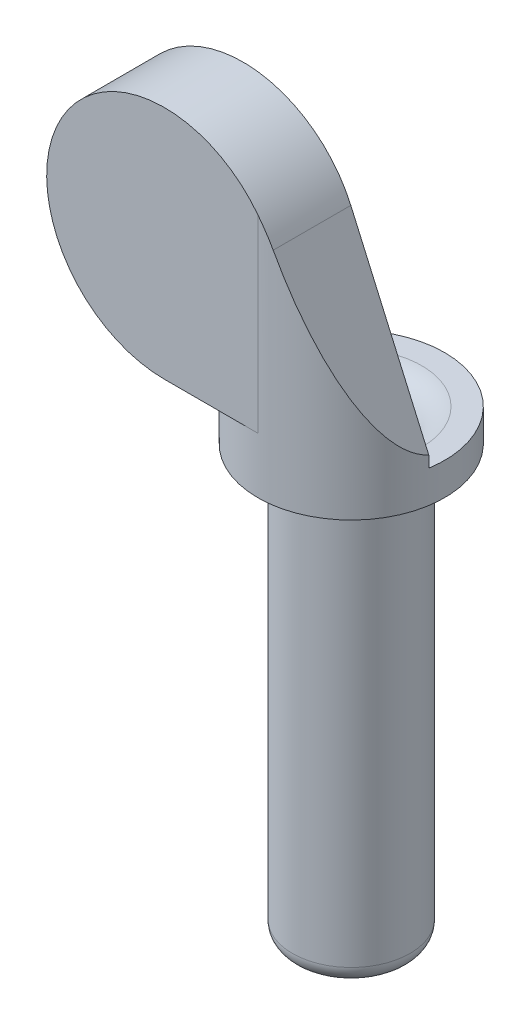
ISO-10303-21;
HEADER;
FILE_DESCRIPTION(('STEP AP214'),'2;1');
FILE_NAME('part.step','',(''),(''),'','','');
FILE_SCHEMA(('AUTOMOTIVE_DESIGN { 1 0 10303 214 1 1 1 1 }'));
ENDSEC;
DATA;
#1=APPLICATION_CONTEXT('core data for automotive mechanical design processes');
#2=APPLICATION_PROTOCOL_DEFINITION('international standard','automotive_design',2000,#1);
#3=PRODUCT_CONTEXT('',#1,'mechanical');
#4=PRODUCT('Part','Part','',(#3));
#5=PRODUCT_RELATED_PRODUCT_CATEGORY('part','',(#4));
#6=PRODUCT_DEFINITION_FORMATION('','',#4);
#7=PRODUCT_DEFINITION_CONTEXT('part definition',#1,'design');
#8=PRODUCT_DEFINITION('design','',#6,#7);
#9=PRODUCT_DEFINITION_SHAPE('','',#8);
#10=(LENGTH_UNIT() NAMED_UNIT(*) SI_UNIT(.MILLI.,.METRE.));
#11=(NAMED_UNIT(*) PLANE_ANGLE_UNIT() SI_UNIT($,.RADIAN.));
#12=(NAMED_UNIT(*) SI_UNIT($,.STERADIAN.) SOLID_ANGLE_UNIT());
#13=UNCERTAINTY_MEASURE_WITH_UNIT(LENGTH_MEASURE(1.E-05),#10,'distance_accuracy_value','');
#14=(GEOMETRIC_REPRESENTATION_CONTEXT(3) GLOBAL_UNCERTAINTY_ASSIGNED_CONTEXT((#13)) GLOBAL_UNIT_ASSIGNED_CONTEXT((#10,
#11,#12)) REPRESENTATION_CONTEXT('',''));
#15=CARTESIAN_POINT('',(0.,0.,0.));
#16=DIRECTION('',(0.,0.,1.));
#17=DIRECTION('',(1.,0.,0.));
#18=AXIS2_PLACEMENT_3D('',#15,#16,#17);
#19=CARTESIAN_POINT('',(-3.175,20.5,3.175));
#20=DIRECTION('',(0.,0.,1.));
#21=DIRECTION('',(1.,0.,0.));
#22=AXIS2_PLACEMENT_3D('',#19,#20,#21);
#23=PLANE('',#22);
#24=CARTESIAN_POINT('',(-3.175,20.5,3.175));
#25=DIRECTION('',(0.,0.,1.));
#26=DIRECTION('',(1.,0.,0.));
#27=AXIS2_PLACEMENT_3D('',#24,#25,#26);
#28=CIRCLE('',#27,4.);
#29=CARTESIAN_POINT('',(0.,22.9329765720204,3.175));
#30=VERTEX_POINT('',#29);
#31=CARTESIAN_POINT('',(-3.175,16.5,3.175));
#32=VERTEX_POINT('',#31);
#33=EDGE_CURVE('E124',#30,#32,#28,.T.);
#34=ORIENTED_EDGE('',*,*,#33,.T.);
#35=DIRECTION('',(-1.,0.,0.));
#36=VECTOR('',#35,1.);
#37=CARTESIAN_POINT('',(-3.175,16.5,3.175));
#38=LINE('',#37,#36);
#39=CARTESIAN_POINT('',(0.,16.5,3.175));
#40=VERTEX_POINT('',#39);
#41=EDGE_CURVE('E117',#40,#32,#38,.T.);
#42=ORIENTED_EDGE('',*,*,#41,.F.);
#43=DIRECTION('',(0.,-1.,0.));
#44=VECTOR('',#43,1.);
#45=CARTESIAN_POINT('',(0.,24.5,3.175));
#46=LINE('',#45,#44);
#47=EDGE_CURVE('E393',#30,#40,#46,.T.);
#48=ORIENTED_EDGE('',*,*,#47,.F.);
#49=EDGE_LOOP('',(#34,#42,#48));
#50=FACE_BOUND('',#49,.T.);
#51=ADVANCED_FACE('F41',(#50),#23,.T.);
#52=CARTESIAN_POINT('',(0.,16.,0.));
#53=DIRECTION('',(0.,-1.,0.));
#54=DIRECTION('',(0.,0.,-1.));
#55=AXIS2_PLACEMENT_3D('',#52,#53,#54);
#56=CYLINDRICAL_SURFACE('',#55,2.);
#57=CARTESIAN_POINT('',(0.,0.6,0.));
#58=DIRECTION('',(0.,1.,0.));
#59=DIRECTION('',(0.,0.,1.));
#60=AXIS2_PLACEMENT_3D('',#57,#58,#59);
#61=CIRCLE('',#60,2.);
#62=CARTESIAN_POINT('',(0.,0.6,2.));
#63=VERTEX_POINT('',#62);
#64=EDGE_CURVE('E161',#63,#63,#61,.T.);
#65=ORIENTED_EDGE('',*,*,#64,.T.);
#66=EDGE_LOOP('',(#65));
#67=FACE_BOUND('',#66,.T.);
#68=CARTESIAN_POINT('',(0.,14.6,0.));
#69=DIRECTION('',(0.,1.,0.));
#70=DIRECTION('',(0.,0.,1.));
#71=AXIS2_PLACEMENT_3D('',#68,#69,#70);
#72=CIRCLE('',#71,2.);
#73=CARTESIAN_POINT('',(0.,14.6,2.));
#74=VERTEX_POINT('',#73);
#75=EDGE_CURVE('E166',#74,#74,#72,.T.);
#76=ORIENTED_EDGE('',*,*,#75,.F.);
#77=EDGE_LOOP('',(#76));
#78=FACE_BOUND('',#77,.T.);
#79=ADVANCED_FACE('F219',(#67,#78),#56,.T.);
#80=CARTESIAN_POINT('',(0.,0.,0.));
#81=DIRECTION('',(0.,1.,0.));
#82=DIRECTION('',(0.,0.,1.));
#83=AXIS2_PLACEMENT_3D('',#80,#81,#82);
#84=PLANE('',#83);
#85=CARTESIAN_POINT('',(0.,0.,0.));
#86=DIRECTION('',(0.,1.,0.));
#87=DIRECTION('',(0.,0.,1.));
#88=AXIS2_PLACEMENT_3D('',#85,#86,#87);
#89=CIRCLE('',#88,1.4);
#90=CARTESIAN_POINT('',(1.3076696830622,0.,0.500000000000001));
#91=VERTEX_POINT('',#90);
#92=CARTESIAN_POINT('',(-1.3076696830622,0.,0.500000000000002));
#93=VERTEX_POINT('',#92);
#94=EDGE_CURVE('E165',#91,#93,#89,.F.);
#95=ORIENTED_EDGE('',*,*,#94,.T.);
#96=DIRECTION('',(1.,0.,0.));
#97=VECTOR('',#96,1.);
#98=CARTESIAN_POINT('',(-1.3076696830622,0.,0.500000000000002));
#99=LINE('',#98,#97);
#100=EDGE_CURVE('E150',#91,#93,#99,.F.);
#101=ORIENTED_EDGE('',*,*,#100,.F.);
#102=EDGE_LOOP('',(#95,#101));
#103=FACE_BOUND('',#102,.T.);
#104=ADVANCED_FACE('F259',(#103),#84,.F.);
#105=CARTESIAN_POINT('',(0.,0.6,0.));
#106=DIRECTION('',(0.,1.,0.));
#107=DIRECTION('',(0.,0.,1.));
#108=AXIS2_PLACEMENT_3D('',#105,#106,#107);
#109=TOROIDAL_SURFACE('',#108,1.4,0.6);
#110=CARTESIAN_POINT('',(0.,0.,0.));
#111=DIRECTION('',(0.,-1.,0.));
#112=DIRECTION('',(0.,0.,-1.));
#113=AXIS2_PLACEMENT_3D('',#110,#111,#112);
#114=CIRCLE('',#113,1.4);
#115=EDGE_CURVE('E171',#93,#91,#114,.T.);
#116=ORIENTED_EDGE('',*,*,#115,.F.);
#117=ORIENTED_EDGE('',*,*,#94,.F.);
#118=EDGE_LOOP('',(#116,#117));
#119=FACE_BOUND('',#118,.T.);
#120=ORIENTED_EDGE('',*,*,#64,.F.);
#121=EDGE_LOOP('',(#120));
#122=FACE_BOUND('',#121,.T.);
#123=ADVANCED_FACE('F251',(#119,#122),#109,.T.);
#124=CARTESIAN_POINT('',(0.,14.6,0.));
#125=DIRECTION('',(0.,1.,0.));
#126=DIRECTION('',(0.,0.,1.));
#127=AXIS2_PLACEMENT_3D('',#124,#125,#126);
#128=CYLINDRICAL_SURFACE('',#127,3.175);
#129=CARTESIAN_POINT('',(0.,15.7,0.));
#130=DIRECTION('',(0.,1.,0.));
#131=DIRECTION('',(0.,0.,-1.));
#132=AXIS2_PLACEMENT_3D('',#129,#130,#131);
#133=CIRCLE('',#132,3.175);
#134=CARTESIAN_POINT('',(3.13538275175456,15.7,0.5));
#135=VERTEX_POINT('',#134);
#136=CARTESIAN_POINT('',(-3.13538275175456,15.7,0.500000000000001));
#137=VERTEX_POINT('',#136);
#138=EDGE_CURVE('E395',#135,#137,#133,.T.);
#139=ORIENTED_EDGE('',*,*,#138,.F.);
#140=DIRECTION('',(0.,-1.,0.));
#141=VECTOR('',#140,1.);
#142=CARTESIAN_POINT('',(3.13538275175456,24.5,0.5));
#143=LINE('',#142,#141);
#144=CARTESIAN_POINT('',(3.13538275175456,16.090041882608,0.5));
#145=VERTEX_POINT('',#144);
#146=EDGE_CURVE('E388',#145,#135,#143,.T.);
#147=ORIENTED_EDGE('',*,*,#146,.F.);
#148=CARTESIAN_POINT('',(0.,23.2161240354019,0.));
#149=DIRECTION('',(-0.915319454600052,-0.402728563713406,0.));
#150=DIRECTION('',(0.402728563713406,-0.915319454600052,0.));
#151=AXIS2_PLACEMENT_3D('',#148,#149,#150);
#152=ELLIPSE('',#151,7.88372190620052,3.17500000000005);
#153=CARTESIAN_POINT('',(0.486277818400209,22.1109142548536,3.13754026003363));
#154=VERTEX_POINT('',#153);
#155=EDGE_CURVE('E236',#154,#145,#152,.F.);
#156=ORIENTED_EDGE('',*,*,#155,.F.);
#157=CARTESIAN_POINT('',(0.,22.9329765720204,3.175));
#158=CARTESIAN_POINT('',(0.0486745483315564,22.8694630838091,3.17499631223018));
#159=CARTESIAN_POINT('',(0.0954294657140837,22.8044949193422,3.17388086811998));
#160=CARTESIAN_POINT('',(0.184770710929604,22.6721607264799,3.16993406051462));
#161=CARTESIAN_POINT('',(0.227372222844302,22.6048047622013,3.16710924202384));
#162=CARTESIAN_POINT('',(0.308448202056237,22.4677223495491,3.16024379635572));
#163=CARTESIAN_POINT('',(0.346922861070821,22.3979960114922,3.15620322569064));
#164=CARTESIAN_POINT('',(0.419767709006462,22.2561407477755,3.14734224861686));
#165=CARTESIAN_POINT('',(0.454121664912938,22.184003664894,3.14251892347416));
#166=CARTESIAN_POINT('',(0.486277818400206,22.1109142548536,3.13754026003363));
#167=B_SPLINE_CURVE_WITH_KNOTS('',3,(#157,#158,#159,#160,#161,#162,#163,#164,#165,#166),
.UNSPECIFIED.,.F.,.F.,(4,2,2,2,4),(0.,0.239997366257403,0.47908157291789,0.718154667851996,
0.958140614410714),.UNSPECIFIED.);
#168=EDGE_CURVE('E226',#30,#154,#167,.T.);
#169=ORIENTED_EDGE('',*,*,#168,.F.);
#170=ORIENTED_EDGE('',*,*,#47,.T.);
#171=CARTESIAN_POINT('',(0.,16.5,0.));
#172=DIRECTION('',(0.,1.,0.));
#173=DIRECTION('',(0.,0.,-1.));
#174=AXIS2_PLACEMENT_3D('',#171,#172,#173);
#175=CIRCLE('',#174,3.175);
#176=CARTESIAN_POINT('',(-3.13538275175456,16.5,0.500000000000001));
#177=VERTEX_POINT('',#176);
#178=EDGE_CURVE('E136',#177,#40,#175,.T.);
#179=ORIENTED_EDGE('',*,*,#178,.F.);
#180=DIRECTION('',(0.,1.,0.));
#181=VECTOR('',#180,1.);
#182=CARTESIAN_POINT('',(-3.13538275175456,15.7,0.500000000000001));
#183=LINE('',#182,#181);
#184=EDGE_CURVE('E133',#137,#177,#183,.T.);
#185=ORIENTED_EDGE('',*,*,#184,.F.);
#186=EDGE_LOOP('',(#139,#147,#156,#169,#170,#179,#185));
#187=FACE_BOUND('',#186,.T.);
#188=CARTESIAN_POINT('',(0.,14.6,0.));
#189=DIRECTION('',(0.,1.,0.));
#190=DIRECTION('',(0.,0.,1.));
#191=AXIS2_PLACEMENT_3D('',#188,#189,#190);
#192=CIRCLE('',#191,3.175);
#193=CARTESIAN_POINT('',(0.,14.6,3.175));
#194=VERTEX_POINT('',#193);
#195=EDGE_CURVE('E143',#194,#194,#192,.T.);
#196=ORIENTED_EDGE('',*,*,#195,.T.);
#197=EDGE_LOOP('',(#196));
#198=FACE_BOUND('',#197,.T.);
#199=ADVANCED_FACE('F205',(#187,#198),#128,.T.);
#200=CARTESIAN_POINT('',(0.,14.6,0.));
#201=DIRECTION('',(0.,1.,0.));
#202=DIRECTION('',(0.,0.,1.));
#203=AXIS2_PLACEMENT_3D('',#200,#201,#202);
#204=PLANE('',#203);
#205=ORIENTED_EDGE('',*,*,#75,.T.);
#206=EDGE_LOOP('',(#205));
#207=FACE_BOUND('',#206,.T.);
#208=ORIENTED_EDGE('',*,*,#195,.F.);
#209=EDGE_LOOP('',(#208));
#210=FACE_BOUND('',#209,.T.);
#211=ADVANCED_FACE('F211',(#207,#210),#204,.F.);
#212=CARTESIAN_POINT('',(-3.175,20.5,2.5));
#213=DIRECTION('',(0.,0.,-1.));
#214=DIRECTION('',(-1.,0.,0.));
#215=AXIS2_PLACEMENT_3D('',#212,#213,#214);
#216=PLANE('',#215);
#217=CARTESIAN_POINT('',(-3.175,20.5,2.5));
#218=DIRECTION('',(0.,0.,-1.));
#219=DIRECTION('',(-1.,0.,0.));
#220=AXIS2_PLACEMENT_3D('',#217,#218,#219);
#221=CIRCLE('',#220,1.65);
#222=CARTESIAN_POINT('',(-4.825,20.5,2.5));
#223=VERTEX_POINT('',#222);
#224=EDGE_CURVE('E147',#223,#223,#221,.T.);
#225=ORIENTED_EDGE('',*,*,#224,.T.);
#226=EDGE_LOOP('',(#225));
#227=FACE_BOUND('',#226,.T.);
#228=ADVANCED_FACE('F207',(#227),#216,.T.);
#229=CARTESIAN_POINT('',(-3.175,20.5,3.175));
#230=DIRECTION('',(0.,0.,-1.));
#231=DIRECTION('',(-1.,0.,0.));
#232=AXIS2_PLACEMENT_3D('',#229,#230,#231);
#233=CYLINDRICAL_SURFACE('',#232,4.);
#234=ORIENTED_EDGE('',*,*,#33,.F.);
#235=ORIENTED_EDGE('',*,*,#168,.T.);
#236=DIRECTION('',(0.,0.,-1.));
#237=VECTOR('',#236,1.);
#238=CARTESIAN_POINT('',(0.486277818400209,22.1109142548536,3.175));
#239=LINE('',#238,#237);
#240=CARTESIAN_POINT('',(0.486277818400208,22.1109142548536,0.5));
#241=VERTEX_POINT('',#240);
#242=EDGE_CURVE('E123',#154,#241,#239,.T.);
#243=ORIENTED_EDGE('',*,*,#242,.T.);
#244=CARTESIAN_POINT('',(-3.175,20.5,0.500000000000001));
#245=DIRECTION('',(0.,0.,-1.));
#246=DIRECTION('',(-1.,0.,0.));
#247=AXIS2_PLACEMENT_3D('',#244,#245,#246);
#248=CIRCLE('',#247,4.);
#249=CARTESIAN_POINT('',(-3.175,16.5,0.500000000000001));
#250=VERTEX_POINT('',#249);
#251=EDGE_CURVE('E130',#250,#241,#248,.T.);
#252=ORIENTED_EDGE('',*,*,#251,.F.);
#253=DIRECTION('',(0.,0.,-1.));
#254=VECTOR('',#253,1.);
#255=CARTESIAN_POINT('',(-3.175,16.5,3.175));
#256=LINE('',#255,#254);
#257=EDGE_CURVE('E112',#32,#250,#256,.T.);
#258=ORIENTED_EDGE('',*,*,#257,.F.);
#259=EDGE_LOOP('',(#234,#235,#243,#252,#258));
#260=FACE_BOUND('',#259,.T.);
#261=ADVANCED_FACE('F138',(#260),#233,.T.);
#262=CARTESIAN_POINT('',(3.175,16.,3.175));
#263=DIRECTION('',(-0.915319454600052,-0.402728563713406,0.));
#264=DIRECTION('',(0.402728563713406,-0.915319454600052,0.));
#265=AXIS2_PLACEMENT_3D('',#262,#263,#264);
#266=PLANE('',#265);
#267=ORIENTED_EDGE('',*,*,#242,.F.);
#268=ORIENTED_EDGE('',*,*,#155,.T.);
#269=DIRECTION('',(0.402728563713406,-0.915319454600052,0.));
#270=VECTOR('',#269,1.);
#271=CARTESIAN_POINT('',(3.175,16.,0.5));
#272=LINE('',#271,#270);
#273=EDGE_CURVE('E142',#241,#145,#272,.T.);
#274=ORIENTED_EDGE('',*,*,#273,.F.);
#275=EDGE_LOOP('',(#267,#268,#274));
#276=FACE_BOUND('',#275,.T.);
#277=ADVANCED_FACE('F215',(#276),#266,.F.);
#278=CARTESIAN_POINT('',(-3.175,20.5,2.5));
#279=DIRECTION('',(0.,0.,-1.));
#280=DIRECTION('',(-1.,0.,0.));
#281=AXIS2_PLACEMENT_3D('',#278,#279,#280);
#282=CYLINDRICAL_SURFACE('',#281,1.65);
#283=CARTESIAN_POINT('',(-3.175,20.5,0.800000000000001));
#284=DIRECTION('',(0.,0.,-1.));
#285=DIRECTION('',(-1.,0.,0.));
#286=AXIS2_PLACEMENT_3D('',#283,#284,#285);
#287=CIRCLE('',#286,1.65);
#288=CARTESIAN_POINT('',(-4.825,20.5,0.800000000000001));
#289=VERTEX_POINT('',#288);
#290=EDGE_CURVE('E175',#289,#289,#287,.T.);
#291=ORIENTED_EDGE('',*,*,#290,.T.);
#292=EDGE_LOOP('',(#291));
#293=FACE_BOUND('',#292,.T.);
#294=ORIENTED_EDGE('',*,*,#224,.F.);
#295=EDGE_LOOP('',(#294));
#296=FACE_BOUND('',#295,.T.);
#297=ADVANCED_FACE('F204',(#293,#296),#282,.F.);
#298=CARTESIAN_POINT('',(3.175,24.5,0.5));
#299=DIRECTION('',(0.,0.,-1.));
#300=DIRECTION('',(-1.,0.,0.));
#301=AXIS2_PLACEMENT_3D('',#298,#299,#300);
#302=PLANE('',#301);
#303=ORIENTED_EDGE('',*,*,#184,.T.);
#304=DIRECTION('',(1.,0.,0.));
#305=VECTOR('',#304,1.);
#306=CARTESIAN_POINT('',(-3.13538275175456,16.5,0.500000000000001));
#307=LINE('',#306,#305);
#308=EDGE_CURVE('E115',#250,#177,#307,.T.);
#309=ORIENTED_EDGE('',*,*,#308,.F.);
#310=ORIENTED_EDGE('',*,*,#251,.T.);
#311=ORIENTED_EDGE('',*,*,#273,.T.);
#312=ORIENTED_EDGE('',*,*,#146,.T.);
#313=DIRECTION('',(1.,0.,0.));
#314=VECTOR('',#313,1.);
#315=CARTESIAN_POINT('',(-3.13538275175456,15.7,0.500000000000001));
#316=LINE('',#315,#314);
#317=CARTESIAN_POINT('',(2.3473389188611,15.7,0.5));
#318=VERTEX_POINT('',#317);
#319=EDGE_CURVE('E390',#318,#135,#316,.T.);
#320=ORIENTED_EDGE('',*,*,#319,.F.);
#321=CARTESIAN_POINT('',(2.3473389188611,15.7,0.5));
#322=CARTESIAN_POINT('',(2.28786296516682,15.7000444900482,0.5));
#323=CARTESIAN_POINT('',(2.22841631556277,15.6949271495817,0.5));
#324=CARTESIAN_POINT('',(2.11127449472661,15.6748138887513,0.5));
#325=CARTESIAN_POINT('',(2.05357765257894,15.6598277242419,0.5));
#326=CARTESIAN_POINT('',(1.94149693667241,15.6204176146967,0.5));
#327=CARTESIAN_POINT('',(1.88711350836565,15.5959924039118,0.5));
#328=CARTESIAN_POINT('',(1.78318025890557,15.53840998603,0.5));
#329=CARTESIAN_POINT('',(1.73363065291909,15.5052523904733,0.5));
#330=CARTESIAN_POINT('',(1.64058887172607,15.4309005014392,0.5));
#331=CARTESIAN_POINT('',(1.59712605674738,15.3896694099007,0.5));
#332=CARTESIAN_POINT('',(1.51792570118299,15.3003220423714,0.5));
#333=CARTESIAN_POINT('',(1.48218939306941,15.2522046699663,0.5));
#334=CARTESIAN_POINT('',(1.4205559687986,15.1516293057197,0.5));
#335=CARTESIAN_POINT('',(1.39444157729436,15.0993046148898,0.5));
#336=CARTESIAN_POINT('',(1.35202443409821,14.9908569326868,0.5));
#337=CARTESIAN_POINT('',(1.33570585786261,14.9347402311562,0.5));
#338=CARTESIAN_POINT('',(1.31903575356667,14.8483851847742,0.5));
#339=CARTESIAN_POINT('',(1.31477852772575,14.8188555292162,0.5));
#340=CARTESIAN_POINT('',(1.30909565236767,14.7595563493026,0.5));
#341=CARTESIAN_POINT('',(1.30766705599706,14.7297871070564,0.5));
#342=CARTESIAN_POINT('',(1.3076696830622,14.7,0.5));
#343=B_SPLINE_CURVE_WITH_KNOTS('',3,(#321,#322,#323,#324,#325,#326,#327,#328,#329,#330,#331,
#332,#333,#334,#335,#336,#337,#338,#339,#340,#341,#342),.UNSPECIFIED.,.F.,.F.,(4,2,2,2,2,2,2,2,
2,2,4),(0.,0.178166400718726,0.356156938391611,0.534171352376789,0.712193686665579,
0.891047150547417,1.06992912272504,1.24448004422075,1.4187482251331,1.50813383441571,
1.59742627307344),.UNSPECIFIED.);
#344=CARTESIAN_POINT('',(1.3076696830622,14.7,0.500000000000002));
#345=VERTEX_POINT('',#344);
#346=EDGE_CURVE('E11',#318,#345,#343,.T.);
#347=ORIENTED_EDGE('',*,*,#346,.T.);
#348=DIRECTION('',(0.,-1.,0.));
#349=VECTOR('',#348,1.);
#350=CARTESIAN_POINT('',(1.3076696830622,24.5,0.500000000000002));
#351=LINE('',#350,#349);
#352=EDGE_CURVE('E235',#345,#91,#351,.T.);
#353=ORIENTED_EDGE('',*,*,#352,.T.);
#354=ORIENTED_EDGE('',*,*,#100,.T.);
#355=DIRECTION('',(0.,-1.,0.));
#356=VECTOR('',#355,1.);
#357=CARTESIAN_POINT('',(-1.3076696830622,24.5,0.500000000000002));
#358=LINE('',#357,#356);
#359=CARTESIAN_POINT('',(-1.3076696830622,14.7,0.500000000000002));
#360=VERTEX_POINT('',#359);
#361=EDGE_CURVE('E189',#360,#93,#358,.T.);
#362=ORIENTED_EDGE('',*,*,#361,.F.);
#363=CARTESIAN_POINT('',(-1.3076696830622,14.7,0.500000000000002));
#364=CARTESIAN_POINT('',(-1.30766810532843,14.7270472102613,0.500000000000001));
#365=CARTESIAN_POINT('',(-1.3088453151119,14.7540806050479,0.500000000000001));
#366=CARTESIAN_POINT('',(-1.31353023872556,14.8079375726777,0.5));
#367=CARTESIAN_POINT('',(-1.31703732936688,14.8347611996884,0.500000000000001));
#368=CARTESIAN_POINT('',(-1.33097744574795,14.9144582399721,0.500000000000001));
#369=CARTESIAN_POINT('',(-1.34482979094924,14.9667714858718,0.500000000000001));
#370=CARTESIAN_POINT('',(-1.3810335799895,15.0682876195116,0.500000000000001));
#371=CARTESIAN_POINT('',(-1.40338014022441,15.117492275561,0.500000000000001));
#372=CARTESIAN_POINT('',(-1.45572565954706,15.2116747785507,0.500000000000001));
#373=CARTESIAN_POINT('',(-1.48572922712013,15.2566500575891,0.500000000000001));
#374=CARTESIAN_POINT('',(-1.55366223377084,15.3429140029136,0.500000000000001));
#375=CARTESIAN_POINT('',(-1.59184587536062,15.3840021993872,0.500000000000001));
#376=CARTESIAN_POINT('',(-1.67427060178563,15.4595768028888,0.500000000000001));
#377=CARTESIAN_POINT('',(-1.71851324917782,15.494061501421,0.500000000000001));
#378=CARTESIAN_POINT('',(-1.81426822751567,15.5572076453951,0.500000000000001));
#379=CARTESIAN_POINT('',(-1.86603657433408,15.5854812652143,0.500000000000001));
#380=CARTESIAN_POINT('',(-1.97352304659714,15.633086169027,0.500000000000001));
#381=CARTESIAN_POINT('',(-2.02923968687929,15.6524207950742,0.500000000000001));
#382=CARTESIAN_POINT('',(-2.12879256024882,15.6779281305145,0.500000000000001));
#383=CARTESIAN_POINT('',(-2.17210639621308,15.6861851249689,0.500000000000001));
#384=CARTESIAN_POINT('',(-2.25938620402364,15.6972235882009,0.500000000000001));
#385=CARTESIAN_POINT('',(-2.30335156443086,15.7000098991564,0.500000000000001));
#386=CARTESIAN_POINT('',(-2.3473389188611,15.7,0.500000000000001));
#387=B_SPLINE_CURVE_WITH_KNOTS('',3,(#363,#364,#365,#366,#367,#368,#369,#370,#371,#372,#373,
#374,#375,#376,#377,#378,#379,#380,#381,#382,#383,#384,#385,#386),.UNSPECIFIED.,.F.,.F.,(4,2,2,
2,2,2,2,2,2,2,2,4),(0.,0.0810890560450729,0.162156431383995,0.323658722084393,0.485068299897082,
0.646575254553966,0.814115257207049,0.981698548400455,1.15784912109434,1.33393378237551,
1.46588502062249,1.59771941424978),.UNSPECIFIED.);
#388=CARTESIAN_POINT('',(-2.3473389188611,15.7,0.500000000000001));
#389=VERTEX_POINT('',#388);
#390=EDGE_CURVE('E56',#360,#389,#387,.T.);
#391=ORIENTED_EDGE('',*,*,#390,.T.);
#392=EDGE_CURVE('E400',#137,#389,#316,.T.);
#393=ORIENTED_EDGE('',*,*,#392,.F.);
#394=EDGE_LOOP('',(#303,#309,#310,#311,#312,#320,#347,#353,#354,#362,#391,#393));
#395=FACE_BOUND('',#394,.T.);
#396=CARTESIAN_POINT('',(-3.175,20.5,0.500000000000001));
#397=DIRECTION('',(0.,0.,-1.));
#398=DIRECTION('',(-1.,0.,0.));
#399=AXIS2_PLACEMENT_3D('',#396,#397,#398);
#400=CIRCLE('',#399,1.95);
#401=CARTESIAN_POINT('',(-5.125,20.5,0.500000000000001));
#402=VERTEX_POINT('',#401);
#403=EDGE_CURVE('E170',#402,#402,#400,.F.);
#404=ORIENTED_EDGE('',*,*,#403,.T.);
#405=EDGE_LOOP('',(#404));
#406=FACE_BOUND('',#405,.T.);
#407=ADVANCED_FACE('F127',(#395,#406),#302,.T.);
#408=CARTESIAN_POINT('',(-3.175,20.5,0.800000000000001));
#409=DIRECTION('',(0.,0.,-1.));
#410=DIRECTION('',(-1.,0.,0.));
#411=AXIS2_PLACEMENT_3D('',#408,#409,#410);
#412=TOROIDAL_SURFACE('',#411,1.95,0.3);
#413=ORIENTED_EDGE('',*,*,#290,.F.);
#414=EDGE_LOOP('',(#413));
#415=FACE_BOUND('',#414,.T.);
#416=ORIENTED_EDGE('',*,*,#403,.F.);
#417=EDGE_LOOP('',(#416));
#418=FACE_BOUND('',#417,.T.);
#419=ADVANCED_FACE('F203',(#415,#418),#412,.T.);
#420=CARTESIAN_POINT('',(0.,24.5,0.));
#421=DIRECTION('',(0.,-1.,0.));
#422=DIRECTION('',(0.,0.,-1.));
#423=AXIS2_PLACEMENT_3D('',#420,#421,#422);
#424=CYLINDRICAL_SURFACE('',#423,1.4);
#425=ORIENTED_EDGE('',*,*,#352,.F.);
#426=CARTESIAN_POINT('',(0.,14.7,0.));
#427=DIRECTION('',(0.,-1.,0.));
#428=DIRECTION('',(0.,0.,-1.));
#429=AXIS2_PLACEMENT_3D('',#426,#427,#428);
#430=CIRCLE('',#429,1.4);
#431=EDGE_CURVE('E179',#345,#360,#430,.F.);
#432=ORIENTED_EDGE('',*,*,#431,.T.);
#433=ORIENTED_EDGE('',*,*,#361,.T.);
#434=ORIENTED_EDGE('',*,*,#115,.T.);
#435=EDGE_LOOP('',(#425,#432,#433,#434));
#436=FACE_BOUND('',#435,.T.);
#437=ADVANCED_FACE('F243',(#436),#424,.F.);
#438=CARTESIAN_POINT('',(0.,15.7,0.));
#439=DIRECTION('',(0.,-1.,0.));
#440=DIRECTION('',(0.,0.,-1.));
#441=AXIS2_PLACEMENT_3D('',#438,#439,#440);
#442=PLANE('',#441);
#443=ORIENTED_EDGE('',*,*,#392,.T.);
#444=CARTESIAN_POINT('',(0.,15.7,0.));
#445=DIRECTION('',(0.,-1.,0.));
#446=DIRECTION('',(0.,0.,-1.));
#447=AXIS2_PLACEMENT_3D('',#444,#445,#446);
#448=CIRCLE('',#447,2.4);
#449=EDGE_CURVE('E69',#389,#318,#448,.T.);
#450=ORIENTED_EDGE('',*,*,#449,.T.);
#451=ORIENTED_EDGE('',*,*,#319,.T.);
#452=ORIENTED_EDGE('',*,*,#138,.T.);
#453=EDGE_LOOP('',(#443,#450,#451,#452));
#454=FACE_BOUND('',#453,.T.);
#455=ADVANCED_FACE('F241',(#454),#442,.F.);
#456=CARTESIAN_POINT('',(0.,14.7,0.));
#457=DIRECTION('',(0.,-1.,0.));
#458=DIRECTION('',(0.,0.,-1.));
#459=AXIS2_PLACEMENT_3D('',#456,#457,#458);
#460=TOROIDAL_SURFACE('',#459,2.4,1.);
#461=ORIENTED_EDGE('',*,*,#346,.F.);
#462=ORIENTED_EDGE('',*,*,#449,.F.);
#463=ORIENTED_EDGE('',*,*,#390,.F.);
#464=ORIENTED_EDGE('',*,*,#431,.F.);
#465=EDGE_LOOP('',(#461,#462,#463,#464));
#466=FACE_BOUND('',#465,.T.);
#467=ADVANCED_FACE('F43',(#466),#460,.T.);
#468=CARTESIAN_POINT('',(0.,16.5,0.));
#469=DIRECTION('',(0.,-1.,0.));
#470=DIRECTION('',(0.,0.,-1.));
#471=AXIS2_PLACEMENT_3D('',#468,#469,#470);
#472=PLANE('',#471);
#473=ORIENTED_EDGE('',*,*,#257,.T.);
#474=ORIENTED_EDGE('',*,*,#308,.T.);
#475=ORIENTED_EDGE('',*,*,#178,.T.);
#476=ORIENTED_EDGE('',*,*,#41,.T.);
#477=EDGE_LOOP('',(#473,#474,#475,#476));
#478=FACE_BOUND('',#477,.T.);
#479=ADVANCED_FACE('F114',(#478),#472,.T.);
#480=CLOSED_SHELL('',(#51,#79,#104,#123,#199,#211,#228,#261,#277,#297,#407,#419,#437,#455,#467,#479));
#481=MANIFOLD_SOLID_BREP('B2',#480);
#482=ADVANCED_BREP_SHAPE_REPRESENTATION('',(#18,#481),#14);
#483=SHAPE_DEFINITION_REPRESENTATION(#9,#482);
ENDSEC;
END-ISO-10303-21;
